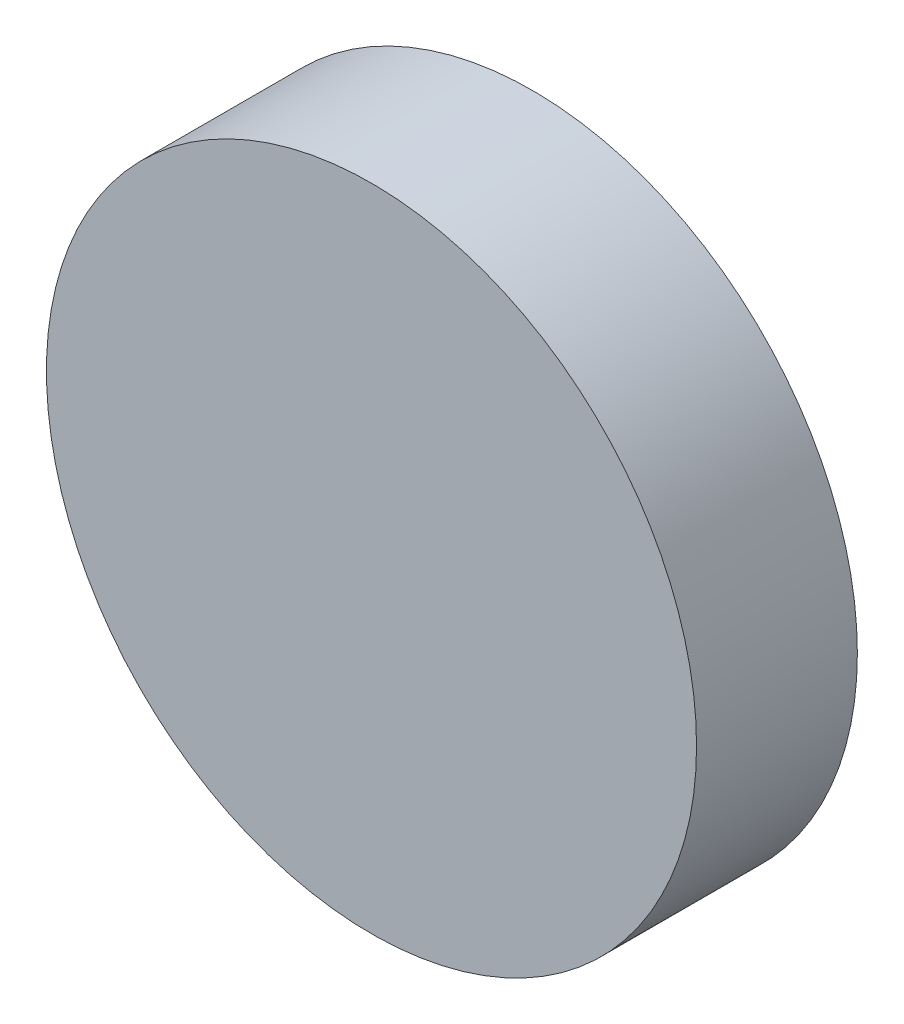
ISO-10303-21;
HEADER;
FILE_DESCRIPTION(('STEP AP214'),'2;1');
FILE_NAME('part.step','',(''),(''),'','','');
FILE_SCHEMA(('AUTOMOTIVE_DESIGN { 1 0 10303 214 1 1 1 1 }'));
ENDSEC;
DATA;
#1=APPLICATION_CONTEXT('core data for automotive mechanical design processes');
#2=APPLICATION_PROTOCOL_DEFINITION('international standard','automotive_design',2000,#1);
#3=PRODUCT_CONTEXT('',#1,'mechanical');
#4=PRODUCT('Part','Part','',(#3));
#5=PRODUCT_RELATED_PRODUCT_CATEGORY('part','',(#4));
#6=PRODUCT_DEFINITION_FORMATION('','',#4);
#7=PRODUCT_DEFINITION_CONTEXT('part definition',#1,'design');
#8=PRODUCT_DEFINITION('design','',#6,#7);
#9=PRODUCT_DEFINITION_SHAPE('','',#8);
#10=(LENGTH_UNIT() NAMED_UNIT(*) SI_UNIT(.MILLI.,.METRE.));
#11=(NAMED_UNIT(*) PLANE_ANGLE_UNIT() SI_UNIT($,.RADIAN.));
#12=(NAMED_UNIT(*) SI_UNIT($,.STERADIAN.) SOLID_ANGLE_UNIT());
#13=UNCERTAINTY_MEASURE_WITH_UNIT(LENGTH_MEASURE(1.E-05),#10,'distance_accuracy_value','');
#14=(GEOMETRIC_REPRESENTATION_CONTEXT(3) GLOBAL_UNCERTAINTY_ASSIGNED_CONTEXT((#13)) GLOBAL_UNIT_ASSIGNED_CONTEXT((#10,
#11,#12)) REPRESENTATION_CONTEXT('',''));
#15=CARTESIAN_POINT('',(0.,0.,0.));
#16=DIRECTION('',(0.,0.,1.));
#17=DIRECTION('',(1.,0.,0.));
#18=AXIS2_PLACEMENT_3D('',#15,#16,#17);
#19=CARTESIAN_POINT('',(0.,0.,2.9718));
#20=DIRECTION('',(0.,0.,-1.));
#21=DIRECTION('',(-1.,0.,0.));
#22=AXIS2_PLACEMENT_3D('',#19,#20,#21);
#23=CYLINDRICAL_SURFACE('',#22,6.0071);
#24=CARTESIAN_POINT('',(0.,0.,2.9718));
#25=DIRECTION('',(0.,0.,1.));
#26=DIRECTION('',(1.,0.,0.));
#27=AXIS2_PLACEMENT_3D('',#24,#25,#26);
#28=CIRCLE('',#27,6.0071);
#29=CARTESIAN_POINT('',(6.0071,0.,2.9718));
#30=VERTEX_POINT('',#29);
#31=EDGE_CURVE('E10',#30,#30,#28,.T.);
#32=ORIENTED_EDGE('',*,*,#31,.F.);
#33=EDGE_LOOP('',(#32));
#34=FACE_BOUND('',#33,.T.);
#35=CARTESIAN_POINT('',(0.,0.,0.));
#36=DIRECTION('',(0.,0.,1.));
#37=DIRECTION('',(1.,0.,0.));
#38=AXIS2_PLACEMENT_3D('',#35,#36,#37);
#39=CIRCLE('',#38,6.0071);
#40=CARTESIAN_POINT('',(6.0071,0.,0.));
#41=VERTEX_POINT('',#40);
#42=EDGE_CURVE('E34',#41,#41,#39,.T.);
#43=ORIENTED_EDGE('',*,*,#42,.T.);
#44=EDGE_LOOP('',(#43));
#45=FACE_BOUND('',#44,.T.);
#46=ADVANCED_FACE('F31',(#34,#45),#23,.T.);
#47=CARTESIAN_POINT('',(0.,0.,2.9718));
#48=DIRECTION('',(0.,0.,1.));
#49=DIRECTION('',(1.,0.,0.));
#50=AXIS2_PLACEMENT_3D('',#47,#48,#49);
#51=PLANE('',#50);
#52=ORIENTED_EDGE('',*,*,#31,.T.);
#53=EDGE_LOOP('',(#52));
#54=FACE_BOUND('',#53,.T.);
#55=ADVANCED_FACE('F46',(#54),#51,.T.);
#56=CARTESIAN_POINT('',(0.,0.,0.));
#57=DIRECTION('',(0.,0.,1.));
#58=DIRECTION('',(1.,0.,0.));
#59=AXIS2_PLACEMENT_3D('',#56,#57,#58);
#60=PLANE('',#59);
#61=ORIENTED_EDGE('',*,*,#42,.F.);
#62=EDGE_LOOP('',(#61));
#63=FACE_BOUND('',#62,.T.);
#64=ADVANCED_FACE('F44',(#63),#60,.F.);
#65=CLOSED_SHELL('',(#46,#55,#64));
#66=MANIFOLD_SOLID_BREP('B2',#65);
#67=ADVANCED_BREP_SHAPE_REPRESENTATION('',(#18,#66),#14);
#68=SHAPE_DEFINITION_REPRESENTATION(#9,#67);
ENDSEC;
END-ISO-10303-21;
